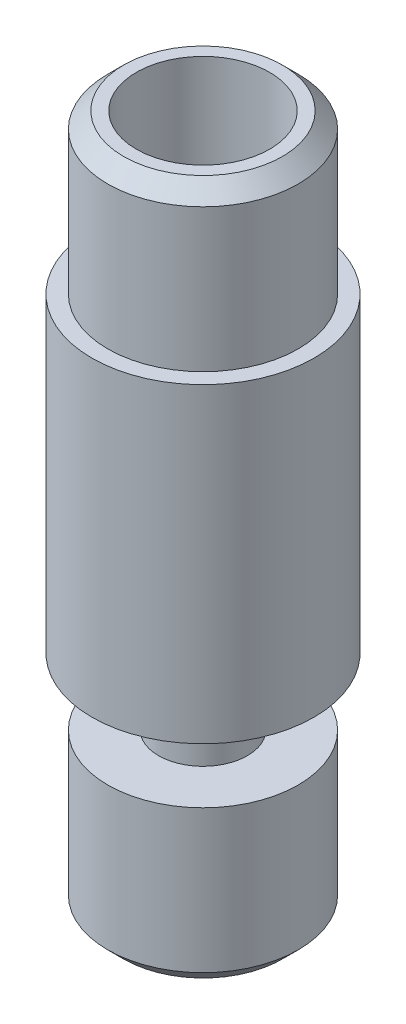
ISO-10303-21;
HEADER;
FILE_DESCRIPTION(('STEP AP214'),'2;1');
FILE_NAME('part.step','',(''),(''),'','','');
FILE_SCHEMA(('AUTOMOTIVE_DESIGN { 1 0 10303 214 1 1 1 1 }'));
ENDSEC;
DATA;
#1=APPLICATION_CONTEXT('core data for automotive mechanical design processes');
#2=APPLICATION_PROTOCOL_DEFINITION('international standard','automotive_design',2000,#1);
#3=PRODUCT_CONTEXT('',#1,'mechanical');
#4=PRODUCT('Part','Part','',(#3));
#5=PRODUCT_RELATED_PRODUCT_CATEGORY('part','',(#4));
#6=PRODUCT_DEFINITION_FORMATION('','',#4);
#7=PRODUCT_DEFINITION_CONTEXT('part definition',#1,'design');
#8=PRODUCT_DEFINITION('design','',#6,#7);
#9=PRODUCT_DEFINITION_SHAPE('','',#8);
#10=(LENGTH_UNIT() NAMED_UNIT(*) SI_UNIT(.MILLI.,.METRE.));
#11=(NAMED_UNIT(*) PLANE_ANGLE_UNIT() SI_UNIT($,.RADIAN.));
#12=(NAMED_UNIT(*) SI_UNIT($,.STERADIAN.) SOLID_ANGLE_UNIT());
#13=UNCERTAINTY_MEASURE_WITH_UNIT(LENGTH_MEASURE(1.E-05),#10,'distance_accuracy_value','');
#14=(GEOMETRIC_REPRESENTATION_CONTEXT(3) GLOBAL_UNCERTAINTY_ASSIGNED_CONTEXT((#13)) GLOBAL_UNIT_ASSIGNED_CONTEXT((#10,
#11,#12)) REPRESENTATION_CONTEXT('',''));
#15=CARTESIAN_POINT('',(0.,0.,0.));
#16=DIRECTION('',(0.,0.,1.));
#17=DIRECTION('',(1.,0.,0.));
#18=AXIS2_PLACEMENT_3D('',#15,#16,#17);
#19=CARTESIAN_POINT('',(0.,0.499999999999998,0.));
#20=DIRECTION('',(0.,1.,0.));
#21=DIRECTION('',(0.,0.,1.));
#22=AXIS2_PLACEMENT_3D('',#19,#20,#21);
#23=CONICAL_SURFACE('',#22,3.,0.78539816339745);
#24=CARTESIAN_POINT('',(0.,2.72844996841357E-11,0.));
#25=DIRECTION('',(0.,1.,0.));
#26=DIRECTION('',(0.,0.,1.));
#27=AXIS2_PLACEMENT_3D('',#24,#25,#26);
#28=CIRCLE('',#27,2.50000000002728);
#29=CARTESIAN_POINT('',(0.,2.72844996841357E-11,2.50000000002728));
#30=VERTEX_POINT('',#29);
#31=EDGE_CURVE('E76',#30,#30,#28,.T.);
#32=ORIENTED_EDGE('',*,*,#31,.T.);
#33=EDGE_LOOP('',(#32));
#34=FACE_BOUND('',#33,.T.);
#35=CARTESIAN_POINT('',(0.,0.499999999999998,0.));
#36=DIRECTION('',(0.,1.,0.));
#37=DIRECTION('',(0.,0.,1.));
#38=AXIS2_PLACEMENT_3D('',#35,#36,#37);
#39=CIRCLE('',#38,3.);
#40=CARTESIAN_POINT('',(0.,0.499999999999998,3.));
#41=VERTEX_POINT('',#40);
#42=EDGE_CURVE('E10',#41,#41,#39,.T.);
#43=ORIENTED_EDGE('',*,*,#42,.F.);
#44=EDGE_LOOP('',(#43));
#45=FACE_BOUND('',#44,.T.);
#46=ADVANCED_FACE('F30',(#34,#45),#23,.T.);
#47=CARTESIAN_POINT('',(0.,0.,0.));
#48=DIRECTION('',(0.,1.,0.));
#49=DIRECTION('',(0.,0.,1.));
#50=AXIS2_PLACEMENT_3D('',#47,#48,#49);
#51=CYLINDRICAL_SURFACE('',#50,3.);
#52=ORIENTED_EDGE('',*,*,#42,.T.);
#53=EDGE_LOOP('',(#52));
#54=FACE_BOUND('',#53,.T.);
#55=CARTESIAN_POINT('',(0.,5.,0.));
#56=DIRECTION('',(0.,1.,0.));
#57=DIRECTION('',(0.,0.,1.));
#58=AXIS2_PLACEMENT_3D('',#55,#56,#57);
#59=CIRCLE('',#58,3.);
#60=CARTESIAN_POINT('',(0.,5.,3.));
#61=VERTEX_POINT('',#60);
#62=EDGE_CURVE('E36',#61,#61,#59,.T.);
#63=ORIENTED_EDGE('',*,*,#62,.F.);
#64=EDGE_LOOP('',(#63));
#65=FACE_BOUND('',#64,.T.);
#66=ADVANCED_FACE('F94',(#54,#65),#51,.T.);
#67=CARTESIAN_POINT('',(1.4,5.,0.));
#68=DIRECTION('',(0.,1.,0.));
#69=DIRECTION('',(0.,0.,1.));
#70=AXIS2_PLACEMENT_3D('',#67,#68,#69);
#71=PLANE('',#70);
#72=ORIENTED_EDGE('',*,*,#62,.T.);
#73=EDGE_LOOP('',(#72));
#74=FACE_BOUND('',#73,.T.);
#75=CARTESIAN_POINT('',(0.,5.,0.));
#76=DIRECTION('',(0.,1.,0.));
#77=DIRECTION('',(0.,0.,1.));
#78=AXIS2_PLACEMENT_3D('',#75,#76,#77);
#79=CIRCLE('',#78,1.4);
#80=CARTESIAN_POINT('',(0.,5.,1.4));
#81=VERTEX_POINT('',#80);
#82=EDGE_CURVE('E40',#81,#81,#79,.T.);
#83=ORIENTED_EDGE('',*,*,#82,.F.);
#84=EDGE_LOOP('',(#83));
#85=FACE_BOUND('',#84,.T.);
#86=ADVANCED_FACE('F98',(#74,#85),#71,.T.);
#87=CARTESIAN_POINT('',(0.,0.,0.));
#88=DIRECTION('',(0.,1.,0.));
#89=DIRECTION('',(0.,0.,1.));
#90=AXIS2_PLACEMENT_3D('',#87,#88,#89);
#91=CYLINDRICAL_SURFACE('',#90,1.4);
#92=ORIENTED_EDGE('',*,*,#82,.T.);
#93=EDGE_LOOP('',(#92));
#94=FACE_BOUND('',#93,.T.);
#95=CARTESIAN_POINT('',(0.,7.1,0.));
#96=DIRECTION('',(0.,1.,0.));
#97=DIRECTION('',(0.,0.,1.));
#98=AXIS2_PLACEMENT_3D('',#95,#96,#97);
#99=CIRCLE('',#98,1.4);
#100=CARTESIAN_POINT('',(0.,7.1,1.4));
#101=VERTEX_POINT('',#100);
#102=EDGE_CURVE('E44',#101,#101,#99,.T.);
#103=ORIENTED_EDGE('',*,*,#102,.F.);
#104=EDGE_LOOP('',(#103));
#105=FACE_BOUND('',#104,.T.);
#106=ADVANCED_FACE('F102',(#94,#105),#91,.T.);
#107=CARTESIAN_POINT('',(3.5,7.1,0.));
#108=DIRECTION('',(0.,-1.,0.));
#109=DIRECTION('',(0.,0.,-1.));
#110=AXIS2_PLACEMENT_3D('',#107,#108,#109);
#111=PLANE('',#110);
#112=ORIENTED_EDGE('',*,*,#102,.T.);
#113=EDGE_LOOP('',(#112));
#114=FACE_BOUND('',#113,.T.);
#115=CARTESIAN_POINT('',(0.,7.1,0.));
#116=DIRECTION('',(0.,1.,0.));
#117=DIRECTION('',(0.,0.,1.));
#118=AXIS2_PLACEMENT_3D('',#115,#116,#117);
#119=CIRCLE('',#118,3.5);
#120=CARTESIAN_POINT('',(0.,7.1,3.5));
#121=VERTEX_POINT('',#120);
#122=EDGE_CURVE('E49',#121,#121,#119,.T.);
#123=ORIENTED_EDGE('',*,*,#122,.F.);
#124=EDGE_LOOP('',(#123));
#125=FACE_BOUND('',#124,.T.);
#126=ADVANCED_FACE('F108',(#114,#125),#111,.T.);
#127=CARTESIAN_POINT('',(0.,0.,0.));
#128=DIRECTION('',(0.,1.,0.));
#129=DIRECTION('',(0.,0.,1.));
#130=AXIS2_PLACEMENT_3D('',#127,#128,#129);
#131=CYLINDRICAL_SURFACE('',#130,3.5);
#132=ORIENTED_EDGE('',*,*,#122,.T.);
#133=EDGE_LOOP('',(#132));
#134=FACE_BOUND('',#133,.T.);
#135=CARTESIAN_POINT('',(0.,16.9,0.));
#136=DIRECTION('',(0.,1.,0.));
#137=DIRECTION('',(0.,0.,1.));
#138=AXIS2_PLACEMENT_3D('',#135,#136,#137);
#139=CIRCLE('',#138,3.5);
#140=CARTESIAN_POINT('',(0.,16.9,3.5));
#141=VERTEX_POINT('',#140);
#142=EDGE_CURVE('E52',#141,#141,#139,.T.);
#143=ORIENTED_EDGE('',*,*,#142,.F.);
#144=EDGE_LOOP('',(#143));
#145=FACE_BOUND('',#144,.T.);
#146=ADVANCED_FACE('F112',(#134,#145),#131,.T.);
#147=CARTESIAN_POINT('',(3.,16.9,0.));
#148=DIRECTION('',(0.,1.,0.));
#149=DIRECTION('',(0.,0.,1.));
#150=AXIS2_PLACEMENT_3D('',#147,#148,#149);
#151=PLANE('',#150);
#152=ORIENTED_EDGE('',*,*,#142,.T.);
#153=EDGE_LOOP('',(#152));
#154=FACE_BOUND('',#153,.T.);
#155=CARTESIAN_POINT('',(0.,16.9,0.));
#156=DIRECTION('',(0.,1.,0.));
#157=DIRECTION('',(0.,0.,1.));
#158=AXIS2_PLACEMENT_3D('',#155,#156,#157);
#159=CIRCLE('',#158,3.);
#160=CARTESIAN_POINT('',(0.,16.9,3.));
#161=VERTEX_POINT('',#160);
#162=EDGE_CURVE('E55',#161,#161,#159,.T.);
#163=ORIENTED_EDGE('',*,*,#162,.F.);
#164=EDGE_LOOP('',(#163));
#165=FACE_BOUND('',#164,.T.);
#166=ADVANCED_FACE('F116',(#154,#165),#151,.T.);
#167=CARTESIAN_POINT('',(0.,0.,0.));
#168=DIRECTION('',(0.,1.,0.));
#169=DIRECTION('',(0.,0.,1.));
#170=AXIS2_PLACEMENT_3D('',#167,#168,#169);
#171=CYLINDRICAL_SURFACE('',#170,3.);
#172=ORIENTED_EDGE('',*,*,#162,.T.);
#173=EDGE_LOOP('',(#172));
#174=FACE_BOUND('',#173,.T.);
#175=CARTESIAN_POINT('',(0.,21.4,0.));
#176=DIRECTION('',(0.,1.,0.));
#177=DIRECTION('',(0.,0.,1.));
#178=AXIS2_PLACEMENT_3D('',#175,#176,#177);
#179=CIRCLE('',#178,3.);
#180=CARTESIAN_POINT('',(0.,21.4,3.));
#181=VERTEX_POINT('',#180);
#182=EDGE_CURVE('E58',#181,#181,#179,.T.);
#183=ORIENTED_EDGE('',*,*,#182,.F.);
#184=EDGE_LOOP('',(#183));
#185=FACE_BOUND('',#184,.T.);
#186=ADVANCED_FACE('F120',(#174,#185),#171,.T.);
#187=CARTESIAN_POINT('',(0.,21.8999999999809,0.));
#188=DIRECTION('',(0.,-1.,0.));
#189=DIRECTION('',(0.,0.,-1.));
#190=AXIS2_PLACEMENT_3D('',#187,#188,#189);
#191=CONICAL_SURFACE('',#190,2.50000000001905,0.78539816339745);
#192=ORIENTED_EDGE('',*,*,#182,.T.);
#193=EDGE_LOOP('',(#192));
#194=FACE_BOUND('',#193,.T.);
#195=CARTESIAN_POINT('',(0.,21.8999999999809,0.));
#196=DIRECTION('',(0.,1.,0.));
#197=DIRECTION('',(0.,0.,1.));
#198=AXIS2_PLACEMENT_3D('',#195,#196,#197);
#199=CIRCLE('',#198,2.50000000001905);
#200=CARTESIAN_POINT('',(0.,21.8999999999809,2.50000000001905));
#201=VERTEX_POINT('',#200);
#202=EDGE_CURVE('E61',#201,#201,#199,.T.);
#203=ORIENTED_EDGE('',*,*,#202,.F.);
#204=EDGE_LOOP('',(#203));
#205=FACE_BOUND('',#204,.T.);
#206=ADVANCED_FACE('F124',(#194,#205),#191,.T.);
#207=CARTESIAN_POINT('',(2.10000000002133,21.8999999999809,0.));
#208=DIRECTION('',(0.,1.,0.));
#209=DIRECTION('',(0.,0.,1.));
#210=AXIS2_PLACEMENT_3D('',#207,#208,#209);
#211=PLANE('',#210);
#212=ORIENTED_EDGE('',*,*,#202,.T.);
#213=EDGE_LOOP('',(#212));
#214=FACE_BOUND('',#213,.T.);
#215=CARTESIAN_POINT('',(0.,21.8999999999809,0.));
#216=DIRECTION('',(0.,1.,0.));
#217=DIRECTION('',(0.,0.,1.));
#218=AXIS2_PLACEMENT_3D('',#215,#216,#217);
#219=CIRCLE('',#218,2.10000000002133);
#220=CARTESIAN_POINT('',(0.,21.8999999999809,2.10000000002133));
#221=VERTEX_POINT('',#220);
#222=EDGE_CURVE('E64',#221,#221,#219,.T.);
#223=ORIENTED_EDGE('',*,*,#222,.F.);
#224=EDGE_LOOP('',(#223));
#225=FACE_BOUND('',#224,.T.);
#226=ADVANCED_FACE('F128',(#214,#225),#211,.T.);
#227=CARTESIAN_POINT('',(0.,0.,0.));
#228=DIRECTION('',(0.,1.,0.));
#229=DIRECTION('',(0.,0.,1.));
#230=AXIS2_PLACEMENT_3D('',#227,#228,#229);
#231=CYLINDRICAL_SURFACE('',#230,2.10000000002133);
#232=ORIENTED_EDGE('',*,*,#222,.T.);
#233=EDGE_LOOP('',(#232));
#234=FACE_BOUND('',#233,.T.);
#235=CARTESIAN_POINT('',(0.,16.8999999999809,0.));
#236=DIRECTION('',(0.,1.,0.));
#237=DIRECTION('',(0.,0.,1.));
#238=AXIS2_PLACEMENT_3D('',#235,#236,#237);
#239=CIRCLE('',#238,2.10000000002133);
#240=CARTESIAN_POINT('',(0.,16.8999999999809,2.10000000002133));
#241=VERTEX_POINT('',#240);
#242=EDGE_CURVE('E67',#241,#241,#239,.T.);
#243=ORIENTED_EDGE('',*,*,#242,.F.);
#244=EDGE_LOOP('',(#243));
#245=FACE_BOUND('',#244,.T.);
#246=ADVANCED_FACE('F132',(#234,#245),#231,.F.);
#247=CARTESIAN_POINT('',(0.,15.7999999999472,0.));
#248=DIRECTION('',(0.,1.,0.));
#249=DIRECTION('',(0.,0.,1.));
#250=AXIS2_PLACEMENT_3D('',#247,#248,#249);
#251=CONICAL_SURFACE('',#250,0.999999999987541,0.785398163397448);
#252=ORIENTED_EDGE('',*,*,#242,.T.);
#253=EDGE_LOOP('',(#252));
#254=FACE_BOUND('',#253,.T.);
#255=CARTESIAN_POINT('',(0.,15.7999999999472,0.));
#256=DIRECTION('',(0.,1.,0.));
#257=DIRECTION('',(0.,0.,1.));
#258=AXIS2_PLACEMENT_3D('',#255,#256,#257);
#259=CIRCLE('',#258,0.999999999987541);
#260=CARTESIAN_POINT('',(0.,15.7999999999472,0.999999999987541));
#261=VERTEX_POINT('',#260);
#262=EDGE_CURVE('E70',#261,#261,#259,.T.);
#263=ORIENTED_EDGE('',*,*,#262,.F.);
#264=EDGE_LOOP('',(#263));
#265=FACE_BOUND('',#264,.T.);
#266=ADVANCED_FACE('F90',(#254,#265),#251,.F.);
#267=CARTESIAN_POINT('',(0.,0.,0.));
#268=DIRECTION('',(0.,1.,0.));
#269=DIRECTION('',(0.,0.,1.));
#270=AXIS2_PLACEMENT_3D('',#267,#268,#269);
#271=CYLINDRICAL_SURFACE('',#270,0.999999999987541);
#272=ORIENTED_EDGE('',*,*,#262,.T.);
#273=EDGE_LOOP('',(#272));
#274=FACE_BOUND('',#273,.T.);
#275=CARTESIAN_POINT('',(0.,2.72844996841357E-11,0.));
#276=DIRECTION('',(0.,1.,0.));
#277=DIRECTION('',(0.,0.,1.));
#278=AXIS2_PLACEMENT_3D('',#275,#276,#277);
#279=CIRCLE('',#278,0.999999999987541);
#280=CARTESIAN_POINT('',(0.,2.72844996841357E-11,0.999999999987541));
#281=VERTEX_POINT('',#280);
#282=EDGE_CURVE('E73',#281,#281,#279,.T.);
#283=ORIENTED_EDGE('',*,*,#282,.F.);
#284=EDGE_LOOP('',(#283));
#285=FACE_BOUND('',#284,.T.);
#286=ADVANCED_FACE('F84',(#274,#285),#271,.F.);
#287=CARTESIAN_POINT('',(2.50000000002728,2.72844996841357E-11,0.));
#288=DIRECTION('',(0.,-1.,0.));
#289=DIRECTION('',(0.,0.,-1.));
#290=AXIS2_PLACEMENT_3D('',#287,#288,#289);
#291=PLANE('',#290);
#292=ORIENTED_EDGE('',*,*,#282,.T.);
#293=EDGE_LOOP('',(#292));
#294=FACE_BOUND('',#293,.T.);
#295=ORIENTED_EDGE('',*,*,#31,.F.);
#296=EDGE_LOOP('',(#295));
#297=FACE_BOUND('',#296,.T.);
#298=ADVANCED_FACE('F82',(#294,#297),#291,.T.);
#299=CLOSED_SHELL('',(#46,#66,#86,#106,#126,#146,#166,#186,#206,#226,#246,#266,#286,#298));
#300=MANIFOLD_SOLID_BREP('B2',#299);
#301=ADVANCED_BREP_SHAPE_REPRESENTATION('',(#18,#300),#14);
#302=SHAPE_DEFINITION_REPRESENTATION(#9,#301);
ENDSEC;
END-ISO-10303-21;
